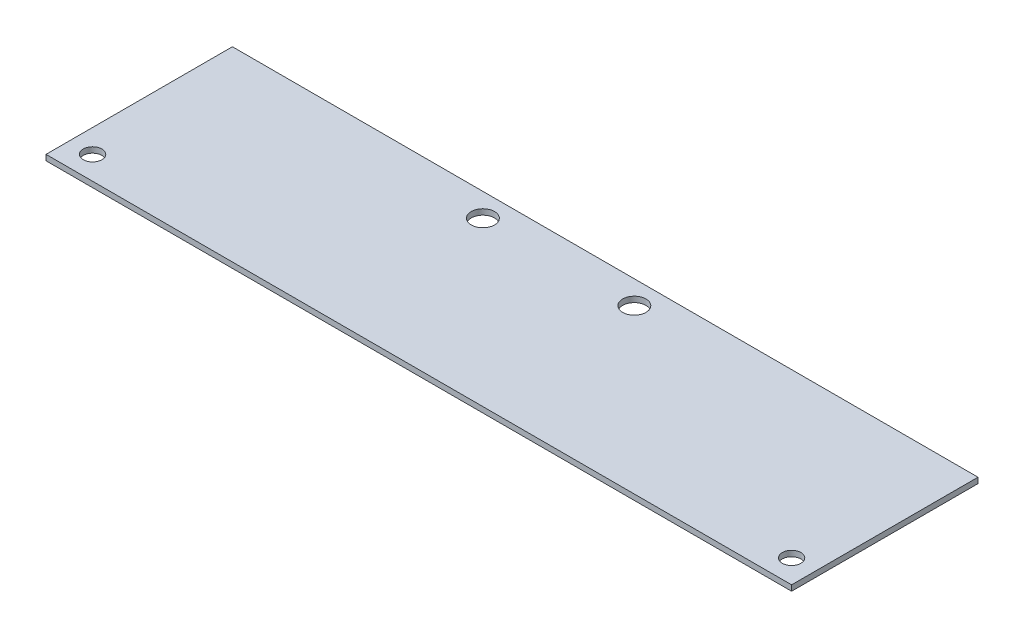
ISO-10303-21;
HEADER;
FILE_DESCRIPTION(('STEP AP214'),'2;1');
FILE_NAME('part.step','',(''),(''),'','','');
FILE_SCHEMA(('AUTOMOTIVE_DESIGN { 1 0 10303 214 1 1 1 1 }'));
ENDSEC;
DATA;
#1=APPLICATION_CONTEXT('core data for automotive mechanical design processes');
#2=APPLICATION_PROTOCOL_DEFINITION('international standard','automotive_design',2000,#1);
#3=PRODUCT_CONTEXT('',#1,'mechanical');
#4=PRODUCT('Part','Part','',(#3));
#5=PRODUCT_RELATED_PRODUCT_CATEGORY('part','',(#4));
#6=PRODUCT_DEFINITION_FORMATION('','',#4);
#7=PRODUCT_DEFINITION_CONTEXT('part definition',#1,'design');
#8=PRODUCT_DEFINITION('design','',#6,#7);
#9=PRODUCT_DEFINITION_SHAPE('','',#8);
#10=(LENGTH_UNIT() NAMED_UNIT(*) SI_UNIT(.MILLI.,.METRE.));
#11=(NAMED_UNIT(*) PLANE_ANGLE_UNIT() SI_UNIT($,.RADIAN.));
#12=(NAMED_UNIT(*) SI_UNIT($,.STERADIAN.) SOLID_ANGLE_UNIT());
#13=UNCERTAINTY_MEASURE_WITH_UNIT(LENGTH_MEASURE(1.E-05),#10,'distance_accuracy_value','');
#14=(GEOMETRIC_REPRESENTATION_CONTEXT(3) GLOBAL_UNCERTAINTY_ASSIGNED_CONTEXT((#13)) GLOBAL_UNIT_ASSIGNED_CONTEXT((#10,
#11,#12)) REPRESENTATION_CONTEXT('',''));
#15=CARTESIAN_POINT('',(0.,0.,0.));
#16=DIRECTION('',(0.,0.,1.));
#17=DIRECTION('',(1.,0.,0.));
#18=AXIS2_PLACEMENT_3D('',#15,#16,#17);
#19=CARTESIAN_POINT('',(0.,1.524,0.));
#20=DIRECTION('',(0.,-1.,0.));
#21=DIRECTION('',(0.,0.,-1.));
#22=AXIS2_PLACEMENT_3D('',#19,#20,#21);
#23=PLANE('',#22);
#24=DIRECTION('',(0.,0.,1.));
#25=VECTOR('',#24,1.);
#26=CARTESIAN_POINT('',(0.,1.524,0.));
#27=LINE('',#26,#25);
#28=CARTESIAN_POINT('',(0.,1.524,-50.8));
#29=VERTEX_POINT('',#28);
#30=CARTESIAN_POINT('',(0.,1.524,0.));
#31=VERTEX_POINT('',#30);
#32=EDGE_CURVE('E95',#29,#31,#27,.T.);
#33=ORIENTED_EDGE('',*,*,#32,.T.);
#34=DIRECTION('',(1.,0.,0.));
#35=VECTOR('',#34,1.);
#36=CARTESIAN_POINT('',(0.,1.524,0.));
#37=LINE('',#36,#35);
#38=CARTESIAN_POINT('',(203.2,1.524,0.));
#39=VERTEX_POINT('',#38);
#40=EDGE_CURVE('E90',#31,#39,#37,.T.);
#41=ORIENTED_EDGE('',*,*,#40,.T.);
#42=DIRECTION('',(0.,0.,-1.));
#43=VECTOR('',#42,1.);
#44=CARTESIAN_POINT('',(203.2,1.524,0.));
#45=LINE('',#44,#43);
#46=CARTESIAN_POINT('',(203.2,1.524,-50.8));
#47=VERTEX_POINT('',#46);
#48=EDGE_CURVE('E93',#39,#47,#45,.T.);
#49=ORIENTED_EDGE('',*,*,#48,.T.);
#50=DIRECTION('',(-1.,0.,0.));
#51=VECTOR('',#50,1.);
#52=CARTESIAN_POINT('',(0.,1.524,-50.8));
#53=LINE('',#52,#51);
#54=EDGE_CURVE('E60',#47,#29,#53,.T.);
#55=ORIENTED_EDGE('',*,*,#54,.T.);
#56=EDGE_LOOP('',(#33,#41,#49,#55));
#57=FACE_BOUND('',#56,.T.);
#58=CARTESIAN_POINT('',(6.35,1.524,-6.35));
#59=DIRECTION('',(0.,1.,0.));
#60=DIRECTION('',(0.,0.,1.));
#61=AXIS2_PLACEMENT_3D('',#58,#59,#60);
#62=CIRCLE('',#61,2.54);
#63=CARTESIAN_POINT('',(6.35,1.524,-3.81));
#64=VERTEX_POINT('',#63);
#65=EDGE_CURVE('E110',#64,#64,#62,.T.);
#66=ORIENTED_EDGE('',*,*,#65,.F.);
#67=EDGE_LOOP('',(#66));
#68=FACE_BOUND('',#67,.T.);
#69=CARTESIAN_POINT('',(196.85,1.524,-6.35));
#70=DIRECTION('',(0.,1.,0.));
#71=DIRECTION('',(0.,0.,1.));
#72=AXIS2_PLACEMENT_3D('',#69,#70,#71);
#73=CIRCLE('',#72,2.53999999999998);
#74=CARTESIAN_POINT('',(196.85,1.524,-3.81000000000002));
#75=VERTEX_POINT('',#74);
#76=EDGE_CURVE('E125',#75,#75,#73,.T.);
#77=ORIENTED_EDGE('',*,*,#76,.F.);
#78=EDGE_LOOP('',(#77));
#79=FACE_BOUND('',#78,.T.);
#80=CARTESIAN_POINT('',(74.6125,1.524,-44.45));
#81=DIRECTION('',(0.,1.,0.));
#82=DIRECTION('',(0.,0.,1.));
#83=AXIS2_PLACEMENT_3D('',#80,#81,#82);
#84=CIRCLE('',#83,3.175);
#85=CARTESIAN_POINT('',(74.6125,1.524,-41.275));
#86=VERTEX_POINT('',#85);
#87=EDGE_CURVE('E131',#86,#86,#84,.T.);
#88=ORIENTED_EDGE('',*,*,#87,.F.);
#89=EDGE_LOOP('',(#88));
#90=FACE_BOUND('',#89,.T.);
#91=CARTESIAN_POINT('',(115.8875,1.524,-44.45));
#92=DIRECTION('',(0.,1.,0.));
#93=DIRECTION('',(0.,0.,1.));
#94=AXIS2_PLACEMENT_3D('',#91,#92,#93);
#95=CIRCLE('',#94,3.17499999999998);
#96=CARTESIAN_POINT('',(115.8875,1.524,-41.275));
#97=VERTEX_POINT('',#96);
#98=EDGE_CURVE('E137',#97,#97,#95,.T.);
#99=ORIENTED_EDGE('',*,*,#98,.F.);
#100=EDGE_LOOP('',(#99));
#101=FACE_BOUND('',#100,.T.);
#102=ADVANCED_FACE('F43',(#57,#68,#79,#90,#101),#23,.F.);
#103=CARTESIAN_POINT('',(0.,0.,0.));
#104=DIRECTION('',(0.,-1.,0.));
#105=DIRECTION('',(0.,0.,-1.));
#106=AXIS2_PLACEMENT_3D('',#103,#104,#105);
#107=PLANE('',#106);
#108=CARTESIAN_POINT('',(74.6125,0.,-44.45));
#109=DIRECTION('',(0.,1.,0.));
#110=DIRECTION('',(0.,0.,1.));
#111=AXIS2_PLACEMENT_3D('',#108,#109,#110);
#112=CIRCLE('',#111,3.175);
#113=CARTESIAN_POINT('',(74.6125,0.,-41.275));
#114=VERTEX_POINT('',#113);
#115=EDGE_CURVE('E134',#114,#114,#112,.T.);
#116=ORIENTED_EDGE('',*,*,#115,.T.);
#117=EDGE_LOOP('',(#116));
#118=FACE_BOUND('',#117,.T.);
#119=CARTESIAN_POINT('',(6.35,0.,-6.35));
#120=DIRECTION('',(0.,1.,0.));
#121=DIRECTION('',(0.,0.,1.));
#122=AXIS2_PLACEMENT_3D('',#119,#120,#121);
#123=CIRCLE('',#122,2.54);
#124=CARTESIAN_POINT('',(6.35,0.,-3.81));
#125=VERTEX_POINT('',#124);
#126=EDGE_CURVE('E122',#125,#125,#123,.T.);
#127=ORIENTED_EDGE('',*,*,#126,.T.);
#128=EDGE_LOOP('',(#127));
#129=FACE_BOUND('',#128,.T.);
#130=DIRECTION('',(0.,0.,1.));
#131=VECTOR('',#130,1.);
#132=CARTESIAN_POINT('',(0.,0.,0.));
#133=LINE('',#132,#131);
#134=CARTESIAN_POINT('',(0.,0.,-50.8));
#135=VERTEX_POINT('',#134);
#136=CARTESIAN_POINT('',(0.,0.,0.));
#137=VERTEX_POINT('',#136);
#138=EDGE_CURVE('E107',#135,#137,#133,.T.);
#139=ORIENTED_EDGE('',*,*,#138,.F.);
#140=DIRECTION('',(-1.,0.,0.));
#141=VECTOR('',#140,1.);
#142=CARTESIAN_POINT('',(0.,0.,-50.8));
#143=LINE('',#142,#141);
#144=CARTESIAN_POINT('',(203.2,0.,-50.8));
#145=VERTEX_POINT('',#144);
#146=EDGE_CURVE('E83',#145,#135,#143,.T.);
#147=ORIENTED_EDGE('',*,*,#146,.F.);
#148=DIRECTION('',(0.,0.,-1.));
#149=VECTOR('',#148,1.);
#150=CARTESIAN_POINT('',(203.2,0.,0.));
#151=LINE('',#150,#149);
#152=CARTESIAN_POINT('',(203.2,0.,0.));
#153=VERTEX_POINT('',#152);
#154=EDGE_CURVE('E77',#153,#145,#151,.T.);
#155=ORIENTED_EDGE('',*,*,#154,.F.);
#156=DIRECTION('',(1.,0.,0.));
#157=VECTOR('',#156,1.);
#158=CARTESIAN_POINT('',(0.,0.,0.));
#159=LINE('',#158,#157);
#160=EDGE_CURVE('E99',#137,#153,#159,.T.);
#161=ORIENTED_EDGE('',*,*,#160,.F.);
#162=EDGE_LOOP('',(#139,#147,#155,#161));
#163=FACE_BOUND('',#162,.T.);
#164=CARTESIAN_POINT('',(196.85,0.,-6.35));
#165=DIRECTION('',(0.,1.,0.));
#166=DIRECTION('',(0.,0.,1.));
#167=AXIS2_PLACEMENT_3D('',#164,#165,#166);
#168=CIRCLE('',#167,2.53999999999998);
#169=CARTESIAN_POINT('',(196.85,0.,-3.81000000000002));
#170=VERTEX_POINT('',#169);
#171=EDGE_CURVE('E128',#170,#170,#168,.T.);
#172=ORIENTED_EDGE('',*,*,#171,.T.);
#173=EDGE_LOOP('',(#172));
#174=FACE_BOUND('',#173,.T.);
#175=CARTESIAN_POINT('',(115.8875,0.,-44.45));
#176=DIRECTION('',(0.,1.,0.));
#177=DIRECTION('',(0.,0.,1.));
#178=AXIS2_PLACEMENT_3D('',#175,#176,#177);
#179=CIRCLE('',#178,3.17499999999998);
#180=CARTESIAN_POINT('',(115.8875,0.,-41.275));
#181=VERTEX_POINT('',#180);
#182=EDGE_CURVE('E140',#181,#181,#179,.T.);
#183=ORIENTED_EDGE('',*,*,#182,.T.);
#184=EDGE_LOOP('',(#183));
#185=FACE_BOUND('',#184,.T.);
#186=ADVANCED_FACE('F118',(#118,#129,#163,#174,#185),#107,.T.);
#187=CARTESIAN_POINT('',(0.,1.524,0.));
#188=DIRECTION('',(1.,0.,0.));
#189=DIRECTION('',(0.,0.,-1.));
#190=AXIS2_PLACEMENT_3D('',#187,#188,#189);
#191=PLANE('',#190);
#192=ORIENTED_EDGE('',*,*,#138,.T.);
#193=DIRECTION('',(0.,-1.,0.));
#194=VECTOR('',#193,1.);
#195=CARTESIAN_POINT('',(0.,1.524,0.));
#196=LINE('',#195,#194);
#197=EDGE_CURVE('E11',#31,#137,#196,.T.);
#198=ORIENTED_EDGE('',*,*,#197,.F.);
#199=ORIENTED_EDGE('',*,*,#32,.F.);
#200=DIRECTION('',(0.,-1.,0.));
#201=VECTOR('',#200,1.);
#202=CARTESIAN_POINT('',(0.,1.524,-50.8));
#203=LINE('',#202,#201);
#204=EDGE_CURVE('E103',#29,#135,#203,.T.);
#205=ORIENTED_EDGE('',*,*,#204,.T.);
#206=EDGE_LOOP('',(#192,#198,#199,#205));
#207=FACE_BOUND('',#206,.T.);
#208=ADVANCED_FACE('F45',(#207),#191,.F.);
#209=CARTESIAN_POINT('',(0.,1.524,0.));
#210=DIRECTION('',(0.,0.,-1.));
#211=DIRECTION('',(-1.,0.,0.));
#212=AXIS2_PLACEMENT_3D('',#209,#210,#211);
#213=PLANE('',#212);
#214=ORIENTED_EDGE('',*,*,#160,.T.);
#215=DIRECTION('',(0.,-1.,0.));
#216=VECTOR('',#215,1.);
#217=CARTESIAN_POINT('',(203.2,1.524,0.));
#218=LINE('',#217,#216);
#219=EDGE_CURVE('E52',#39,#153,#218,.T.);
#220=ORIENTED_EDGE('',*,*,#219,.F.);
#221=ORIENTED_EDGE('',*,*,#40,.F.);
#222=ORIENTED_EDGE('',*,*,#197,.T.);
#223=EDGE_LOOP('',(#214,#220,#221,#222));
#224=FACE_BOUND('',#223,.T.);
#225=ADVANCED_FACE('F98',(#224),#213,.F.);
#226=CARTESIAN_POINT('',(203.2,1.524,0.));
#227=DIRECTION('',(-1.,0.,0.));
#228=DIRECTION('',(0.,0.,1.));
#229=AXIS2_PLACEMENT_3D('',#226,#227,#228);
#230=PLANE('',#229);
#231=ORIENTED_EDGE('',*,*,#154,.T.);
#232=DIRECTION('',(0.,-1.,0.));
#233=VECTOR('',#232,1.);
#234=CARTESIAN_POINT('',(203.2,1.524,-50.8));
#235=LINE('',#234,#233);
#236=EDGE_CURVE('E100',#47,#145,#235,.T.);
#237=ORIENTED_EDGE('',*,*,#236,.F.);
#238=ORIENTED_EDGE('',*,*,#48,.F.);
#239=ORIENTED_EDGE('',*,*,#219,.T.);
#240=EDGE_LOOP('',(#231,#237,#238,#239));
#241=FACE_BOUND('',#240,.T.);
#242=ADVANCED_FACE('F101',(#241),#230,.F.);
#243=CARTESIAN_POINT('',(0.,1.524,-50.8));
#244=DIRECTION('',(0.,0.,1.));
#245=DIRECTION('',(1.,0.,0.));
#246=AXIS2_PLACEMENT_3D('',#243,#244,#245);
#247=PLANE('',#246);
#248=ORIENTED_EDGE('',*,*,#146,.T.);
#249=ORIENTED_EDGE('',*,*,#204,.F.);
#250=ORIENTED_EDGE('',*,*,#54,.F.);
#251=ORIENTED_EDGE('',*,*,#236,.T.);
#252=EDGE_LOOP('',(#248,#249,#250,#251));
#253=FACE_BOUND('',#252,.T.);
#254=ADVANCED_FACE('F115',(#253),#247,.F.);
#255=CARTESIAN_POINT('',(6.35,1.524,-6.35));
#256=DIRECTION('',(0.,-1.,0.));
#257=DIRECTION('',(0.,0.,-1.));
#258=AXIS2_PLACEMENT_3D('',#255,#256,#257);
#259=CYLINDRICAL_SURFACE('',#258,2.54);
#260=ORIENTED_EDGE('',*,*,#65,.T.);
#261=EDGE_LOOP('',(#260));
#262=FACE_BOUND('',#261,.T.);
#263=ORIENTED_EDGE('',*,*,#126,.F.);
#264=EDGE_LOOP('',(#263));
#265=FACE_BOUND('',#264,.T.);
#266=ADVANCED_FACE('F157',(#262,#265),#259,.F.);
#267=CARTESIAN_POINT('',(196.85,1.524,-6.35));
#268=DIRECTION('',(0.,-1.,0.));
#269=DIRECTION('',(0.,0.,-1.));
#270=AXIS2_PLACEMENT_3D('',#267,#268,#269);
#271=CYLINDRICAL_SURFACE('',#270,2.53999999999998);
#272=ORIENTED_EDGE('',*,*,#76,.T.);
#273=EDGE_LOOP('',(#272));
#274=FACE_BOUND('',#273,.T.);
#275=ORIENTED_EDGE('',*,*,#171,.F.);
#276=EDGE_LOOP('',(#275));
#277=FACE_BOUND('',#276,.T.);
#278=ADVANCED_FACE('F202',(#274,#277),#271,.F.);
#279=CARTESIAN_POINT('',(74.6125,1.524,-44.45));
#280=DIRECTION('',(0.,-1.,0.));
#281=DIRECTION('',(0.,0.,-1.));
#282=AXIS2_PLACEMENT_3D('',#279,#280,#281);
#283=CYLINDRICAL_SURFACE('',#282,3.175);
#284=ORIENTED_EDGE('',*,*,#87,.T.);
#285=EDGE_LOOP('',(#284));
#286=FACE_BOUND('',#285,.T.);
#287=ORIENTED_EDGE('',*,*,#115,.F.);
#288=EDGE_LOOP('',(#287));
#289=FACE_BOUND('',#288,.T.);
#290=ADVANCED_FACE('F210',(#286,#289),#283,.F.);
#291=CARTESIAN_POINT('',(115.8875,1.524,-44.45));
#292=DIRECTION('',(0.,-1.,0.));
#293=DIRECTION('',(0.,0.,-1.));
#294=AXIS2_PLACEMENT_3D('',#291,#292,#293);
#295=CYLINDRICAL_SURFACE('',#294,3.17499999999998);
#296=ORIENTED_EDGE('',*,*,#98,.T.);
#297=EDGE_LOOP('',(#296));
#298=FACE_BOUND('',#297,.T.);
#299=ORIENTED_EDGE('',*,*,#182,.F.);
#300=EDGE_LOOP('',(#299));
#301=FACE_BOUND('',#300,.T.);
#302=ADVANCED_FACE('F146',(#298,#301),#295,.F.);
#303=CLOSED_SHELL('',(#102,#186,#208,#225,#242,#254,#266,#278,#290,#302));
#304=MANIFOLD_SOLID_BREP('B2',#303);
#305=ADVANCED_BREP_SHAPE_REPRESENTATION('',(#18,#304),#14);
#306=SHAPE_DEFINITION_REPRESENTATION(#9,#305);
ENDSEC;
END-ISO-10303-21;
